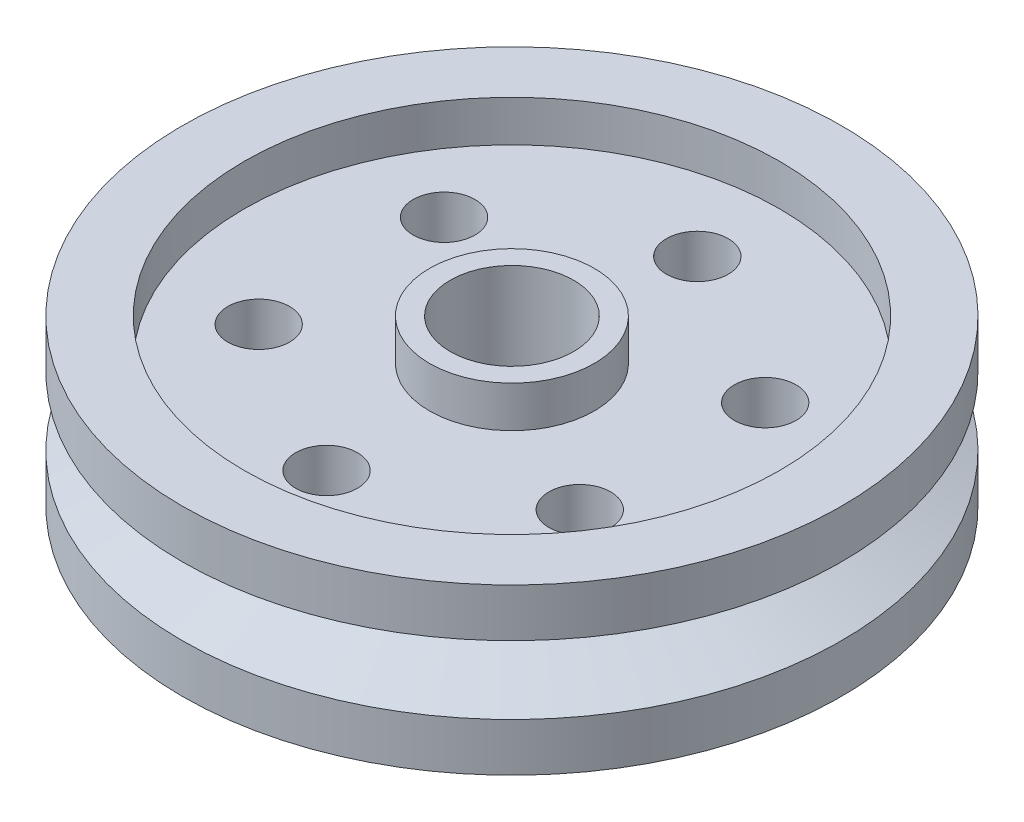
ISO-10303-21;
HEADER;
FILE_DESCRIPTION(('STEP AP214'),'2;1');
FILE_NAME('part.step','',(''),(''),'','','');
FILE_SCHEMA(('AUTOMOTIVE_DESIGN { 1 0 10303 214 1 1 1 1 }'));
ENDSEC;
DATA;
#1=APPLICATION_CONTEXT('core data for automotive mechanical design processes');
#2=APPLICATION_PROTOCOL_DEFINITION('international standard','automotive_design',2000,#1);
#3=PRODUCT_CONTEXT('',#1,'mechanical');
#4=PRODUCT('Part','Part','',(#3));
#5=PRODUCT_RELATED_PRODUCT_CATEGORY('part','',(#4));
#6=PRODUCT_DEFINITION_FORMATION('','',#4);
#7=PRODUCT_DEFINITION_CONTEXT('part definition',#1,'design');
#8=PRODUCT_DEFINITION('design','',#6,#7);
#9=PRODUCT_DEFINITION_SHAPE('','',#8);
#10=(LENGTH_UNIT() NAMED_UNIT(*) SI_UNIT(.MILLI.,.METRE.));
#11=(NAMED_UNIT(*) PLANE_ANGLE_UNIT() SI_UNIT($,.RADIAN.));
#12=(NAMED_UNIT(*) SI_UNIT($,.STERADIAN.) SOLID_ANGLE_UNIT());
#13=UNCERTAINTY_MEASURE_WITH_UNIT(LENGTH_MEASURE(1.E-05),#10,'distance_accuracy_value','');
#14=(GEOMETRIC_REPRESENTATION_CONTEXT(3) GLOBAL_UNCERTAINTY_ASSIGNED_CONTEXT((#13)) GLOBAL_UNIT_ASSIGNED_CONTEXT((#10,
#11,#12)) REPRESENTATION_CONTEXT('',''));
#15=CARTESIAN_POINT('',(0.,0.,0.));
#16=DIRECTION('',(0.,0.,1.));
#17=DIRECTION('',(1.,0.,0.));
#18=AXIS2_PLACEMENT_3D('',#15,#16,#17);
#19=CARTESIAN_POINT('',(0.,12.7,0.));
#20=DIRECTION('',(0.,-1.,0.));
#21=DIRECTION('',(0.,0.,-1.));
#22=AXIS2_PLACEMENT_3D('',#19,#20,#21);
#23=PLANE('',#22);
#24=CARTESIAN_POINT('',(0.,12.7,0.));
#25=DIRECTION('',(0.,1.,0.));
#26=DIRECTION('',(0.,0.,1.));
#27=AXIS2_PLACEMENT_3D('',#24,#25,#26);
#28=CIRCLE('',#27,41.275);
#29=CARTESIAN_POINT('',(0.,12.7,41.275));
#30=VERTEX_POINT('',#29);
#31=EDGE_CURVE('E51',#30,#30,#28,.T.);
#32=ORIENTED_EDGE('',*,*,#31,.F.);
#33=EDGE_LOOP('',(#32));
#34=FACE_BOUND('',#33,.T.);
#35=CARTESIAN_POINT('',(0.,12.7,0.));
#36=DIRECTION('',(0.,1.,0.));
#37=DIRECTION('',(0.,0.,1.));
#38=AXIS2_PLACEMENT_3D('',#35,#36,#37);
#39=CIRCLE('',#38,50.8);
#40=CARTESIAN_POINT('',(0.,12.7,50.8));
#41=VERTEX_POINT('',#40);
#42=EDGE_CURVE('E10',#41,#41,#39,.T.);
#43=ORIENTED_EDGE('',*,*,#42,.T.);
#44=EDGE_LOOP('',(#43));
#45=FACE_BOUND('',#44,.T.);
#46=ADVANCED_FACE('F37',(#34,#45),#23,.F.);
#47=CARTESIAN_POINT('',(0.,218.832128387009,0.));
#48=DIRECTION('',(0.,1.,0.));
#49=DIRECTION('',(0.,0.,1.));
#50=AXIS2_PLACEMENT_3D('',#47,#48,#49);
#51=CYLINDRICAL_SURFACE('',#50,50.8);
#52=ORIENTED_EDGE('',*,*,#42,.F.);
#53=EDGE_LOOP('',(#52));
#54=FACE_BOUND('',#53,.T.);
#55=CARTESIAN_POINT('',(0.,5.26051224213822,0.));
#56=DIRECTION('',(0.,1.,0.));
#57=DIRECTION('',(0.,0.,1.));
#58=AXIS2_PLACEMENT_3D('',#55,#56,#57);
#59=CIRCLE('',#58,50.8);
#60=CARTESIAN_POINT('',(0.,5.26051224213822,50.8));
#61=VERTEX_POINT('',#60);
#62=EDGE_CURVE('E43',#61,#61,#59,.T.);
#63=ORIENTED_EDGE('',*,*,#62,.T.);
#64=EDGE_LOOP('',(#63));
#65=FACE_BOUND('',#64,.T.);
#66=ADVANCED_FACE('F147',(#54,#65),#51,.T.);
#67=CARTESIAN_POINT('',(0.,0.,0.));
#68=DIRECTION('',(0.,1.,0.));
#69=DIRECTION('',(0.,0.,1.));
#70=AXIS2_PLACEMENT_3D('',#67,#68,#69);
#71=CONICAL_SURFACE('',#70,38.1,1.17809724509618);
#72=ORIENTED_EDGE('',*,*,#62,.F.);
#73=EDGE_LOOP('',(#72));
#74=FACE_BOUND('',#73,.T.);
#75=CARTESIAN_POINT('',(0.,0.,0.));
#76=DIRECTION('',(0.,1.,0.));
#77=DIRECTION('',(0.,0.,1.));
#78=AXIS2_PLACEMENT_3D('',#75,#76,#77);
#79=CIRCLE('',#78,38.1);
#80=CARTESIAN_POINT('',(0.,0.,38.1));
#81=VERTEX_POINT('',#80);
#82=EDGE_CURVE('E89',#81,#81,#79,.T.);
#83=ORIENTED_EDGE('',*,*,#82,.T.);
#84=EDGE_LOOP('',(#83));
#85=FACE_BOUND('',#84,.T.);
#86=ADVANCED_FACE('F153',(#74,#85),#71,.T.);
#87=CARTESIAN_POINT('',(0.,6.34999999999999,0.));
#88=DIRECTION('',(0.,1.,0.));
#89=DIRECTION('',(0.,0.,1.));
#90=AXIS2_PLACEMENT_3D('',#87,#88,#89);
#91=CYLINDRICAL_SURFACE('',#90,41.275);
#92=CARTESIAN_POINT('',(0.,6.34999999999999,0.));
#93=DIRECTION('',(0.,1.,0.));
#94=DIRECTION('',(0.,0.,1.));
#95=AXIS2_PLACEMENT_3D('',#92,#93,#94);
#96=CIRCLE('',#95,41.275);
#97=CARTESIAN_POINT('',(0.,6.34999999999999,41.275));
#98=VERTEX_POINT('',#97);
#99=EDGE_CURVE('E47',#98,#98,#96,.T.);
#100=ORIENTED_EDGE('',*,*,#99,.F.);
#101=EDGE_LOOP('',(#100));
#102=FACE_BOUND('',#101,.T.);
#103=ORIENTED_EDGE('',*,*,#31,.T.);
#104=EDGE_LOOP('',(#103));
#105=FACE_BOUND('',#104,.T.);
#106=ADVANCED_FACE('F210',(#102,#105),#91,.F.);
#107=CARTESIAN_POINT('',(0.,6.34999999999999,0.));
#108=DIRECTION('',(0.,1.,0.));
#109=DIRECTION('',(0.,0.,1.));
#110=AXIS2_PLACEMENT_3D('',#107,#108,#109);
#111=PLANE('',#110);
#112=CARTESIAN_POINT('',(-24.7466759131403,6.34999999999999,14.2875000000001));
#113=DIRECTION('',(0.,1.,0.));
#114=DIRECTION('',(0.866025403784436,0.,-0.500000000000004));
#115=AXIS2_PLACEMENT_3D('',#112,#113,#114);
#116=CIRCLE('',#115,4.7625);
#117=CARTESIAN_POINT('',(-20.6222299276169,6.34999999999999,11.9062500000001));
#118=VERTEX_POINT('',#117);
#119=EDGE_CURVE('E71',#118,#118,#116,.T.);
#120=ORIENTED_EDGE('',*,*,#119,.F.);
#121=EDGE_LOOP('',(#120));
#122=FACE_BOUND('',#121,.T.);
#123=CARTESIAN_POINT('',(0.,6.34999999999999,28.575));
#124=DIRECTION('',(0.,1.,0.));
#125=DIRECTION('',(0.,0.,-1.));
#126=AXIS2_PLACEMENT_3D('',#123,#124,#125);
#127=CIRCLE('',#126,4.7625);
#128=CARTESIAN_POINT('',(0.,6.34999999999999,23.8125));
#129=VERTEX_POINT('',#128);
#130=EDGE_CURVE('E79',#129,#129,#127,.T.);
#131=ORIENTED_EDGE('',*,*,#130,.F.);
#132=EDGE_LOOP('',(#131));
#133=FACE_BOUND('',#132,.T.);
#134=CARTESIAN_POINT('',(24.7466759131405,6.34999999999999,14.2874999999998));
#135=DIRECTION('',(0.,1.,0.));
#136=DIRECTION('',(-0.866025403784443,0.,-0.499999999999992));
#137=AXIS2_PLACEMENT_3D('',#134,#135,#136);
#138=CIRCLE('',#137,4.7625);
#139=CARTESIAN_POINT('',(20.6222299276171,6.34999999999999,11.9062499999998));
#140=VERTEX_POINT('',#139);
#141=EDGE_CURVE('E75',#140,#140,#138,.T.);
#142=ORIENTED_EDGE('',*,*,#141,.F.);
#143=EDGE_LOOP('',(#142));
#144=FACE_BOUND('',#143,.T.);
#145=CARTESIAN_POINT('',(24.7466759131402,6.34999999999999,-14.2875000000003));
#146=DIRECTION('',(0.,1.,0.));
#147=DIRECTION('',(-0.866025403784433,0.,0.50000000000001));
#148=AXIS2_PLACEMENT_3D('',#145,#146,#147);
#149=CIRCLE('',#148,4.7625);
#150=CARTESIAN_POINT('',(20.6222299276168,6.34999999999999,-11.9062500000002));
#151=VERTEX_POINT('',#150);
#152=EDGE_CURVE('E72',#151,#151,#149,.T.);
#153=ORIENTED_EDGE('',*,*,#152,.F.);
#154=EDGE_LOOP('',(#153));
#155=FACE_BOUND('',#154,.T.);
#156=CARTESIAN_POINT('',(-24.7466759131404,6.34999999999999,-14.2874999999999));
#157=DIRECTION('',(0.,1.,0.));
#158=DIRECTION('',(0.86602540378444,0.,0.499999999999998));
#159=AXIS2_PLACEMENT_3D('',#156,#157,#158);
#160=CIRCLE('',#159,4.7625);
#161=CARTESIAN_POINT('',(-20.622229927617,6.34999999999999,-11.90625));
#162=VERTEX_POINT('',#161);
#163=EDGE_CURVE('E68',#162,#162,#160,.T.);
#164=ORIENTED_EDGE('',*,*,#163,.F.);
#165=EDGE_LOOP('',(#164));
#166=FACE_BOUND('',#165,.T.);
#167=CARTESIAN_POINT('',(0.,6.34999999999999,-28.575));
#168=DIRECTION('',(0.,1.,0.));
#169=DIRECTION('',(0.,0.,1.));
#170=AXIS2_PLACEMENT_3D('',#167,#168,#169);
#171=CIRCLE('',#170,4.7625);
#172=CARTESIAN_POINT('',(0.,6.34999999999999,-23.8125));
#173=VERTEX_POINT('',#172);
#174=EDGE_CURVE('E65',#173,#173,#171,.T.);
#175=ORIENTED_EDGE('',*,*,#174,.F.);
#176=EDGE_LOOP('',(#175));
#177=FACE_BOUND('',#176,.T.);
#178=CARTESIAN_POINT('',(0.,6.34999999999999,0.));
#179=DIRECTION('',(0.,1.,0.));
#180=DIRECTION('',(0.,0.,1.));
#181=AXIS2_PLACEMENT_3D('',#178,#179,#180);
#182=CIRCLE('',#181,12.7);
#183=CARTESIAN_POINT('',(0.,6.34999999999999,12.7));
#184=VERTEX_POINT('',#183);
#185=EDGE_CURVE('E55',#184,#184,#182,.T.);
#186=ORIENTED_EDGE('',*,*,#185,.F.);
#187=EDGE_LOOP('',(#186));
#188=FACE_BOUND('',#187,.T.);
#189=ORIENTED_EDGE('',*,*,#99,.T.);
#190=EDGE_LOOP('',(#189));
#191=FACE_BOUND('',#190,.T.);
#192=ADVANCED_FACE('F167',(#122,#133,#144,#155,#166,#177,#188,#191),#111,.T.);
#193=CARTESIAN_POINT('',(0.,6.34999999999999,0.));
#194=DIRECTION('',(0.,1.,0.));
#195=DIRECTION('',(0.,0.,1.));
#196=AXIS2_PLACEMENT_3D('',#193,#194,#195);
#197=CYLINDRICAL_SURFACE('',#196,12.7);
#198=ORIENTED_EDGE('',*,*,#185,.T.);
#199=EDGE_LOOP('',(#198));
#200=FACE_BOUND('',#199,.T.);
#201=CARTESIAN_POINT('',(0.,12.7,0.));
#202=DIRECTION('',(0.,1.,0.));
#203=DIRECTION('',(0.,0.,1.));
#204=AXIS2_PLACEMENT_3D('',#201,#202,#203);
#205=CIRCLE('',#204,12.7);
#206=CARTESIAN_POINT('',(0.,12.7,12.7));
#207=VERTEX_POINT('',#206);
#208=EDGE_CURVE('E57',#207,#207,#205,.T.);
#209=ORIENTED_EDGE('',*,*,#208,.F.);
#210=EDGE_LOOP('',(#209));
#211=FACE_BOUND('',#210,.T.);
#212=ADVANCED_FACE('F158',(#200,#211),#197,.T.);
#213=CARTESIAN_POINT('',(0.,12.7,0.));
#214=DIRECTION('',(0.,1.,0.));
#215=DIRECTION('',(0.,0.,1.));
#216=AXIS2_PLACEMENT_3D('',#213,#214,#215);
#217=CIRCLE('',#216,9.525);
#218=CARTESIAN_POINT('',(0.,12.7,9.525));
#219=VERTEX_POINT('',#218);
#220=EDGE_CURVE('E60',#219,#219,#217,.T.);
#221=ORIENTED_EDGE('',*,*,#220,.F.);
#222=EDGE_LOOP('',(#221));
#223=FACE_BOUND('',#222,.T.);
#224=ORIENTED_EDGE('',*,*,#208,.T.);
#225=EDGE_LOOP('',(#224));
#226=FACE_BOUND('',#225,.T.);
#227=ADVANCED_FACE('F149',(#223,#226),#23,.F.);
#228=CARTESIAN_POINT('',(0.,0.,0.));
#229=DIRECTION('',(0.,1.,0.));
#230=DIRECTION('',(0.,0.,1.));
#231=AXIS2_PLACEMENT_3D('',#228,#229,#230);
#232=CYLINDRICAL_SURFACE('',#231,9.525);
#233=ORIENTED_EDGE('',*,*,#220,.T.);
#234=EDGE_LOOP('',(#233));
#235=FACE_BOUND('',#234,.T.);
#236=CARTESIAN_POINT('',(0.,-12.7,0.));
#237=DIRECTION('',(0.,1.,0.));
#238=DIRECTION('',(0.,0.,1.));
#239=AXIS2_PLACEMENT_3D('',#236,#237,#238);
#240=CIRCLE('',#239,9.525);
#241=CARTESIAN_POINT('',(0.,-12.7,9.525));
#242=VERTEX_POINT('',#241);
#243=EDGE_CURVE('E102',#242,#242,#240,.T.);
#244=ORIENTED_EDGE('',*,*,#243,.F.);
#245=EDGE_LOOP('',(#244));
#246=FACE_BOUND('',#245,.T.);
#247=ADVANCED_FACE('F157',(#235,#246),#232,.F.);
#248=CARTESIAN_POINT('',(0.,0.,-28.575));
#249=DIRECTION('',(0.,1.,0.));
#250=DIRECTION('',(0.,0.,1.));
#251=AXIS2_PLACEMENT_3D('',#248,#249,#250);
#252=CYLINDRICAL_SURFACE('',#251,4.7625);
#253=ORIENTED_EDGE('',*,*,#174,.T.);
#254=EDGE_LOOP('',(#253));
#255=FACE_BOUND('',#254,.T.);
#256=CARTESIAN_POINT('',(0.,-6.34999999999999,-28.575));
#257=DIRECTION('',(0.,1.,0.));
#258=DIRECTION('',(0.,0.,1.));
#259=AXIS2_PLACEMENT_3D('',#256,#257,#258);
#260=CIRCLE('',#259,4.7625);
#261=CARTESIAN_POINT('',(0.,-6.34999999999999,-23.8125));
#262=VERTEX_POINT('',#261);
#263=EDGE_CURVE('E107',#262,#262,#260,.T.);
#264=ORIENTED_EDGE('',*,*,#263,.F.);
#265=EDGE_LOOP('',(#264));
#266=FACE_BOUND('',#265,.T.);
#267=ADVANCED_FACE('F164',(#255,#266),#252,.F.);
#268=CARTESIAN_POINT('',(-24.7466759131404,0.,-14.2874999999999));
#269=DIRECTION('',(0.,1.,0.));
#270=DIRECTION('',(0.,0.,1.));
#271=AXIS2_PLACEMENT_3D('',#268,#269,#270);
#272=CYLINDRICAL_SURFACE('',#271,4.7625);
#273=ORIENTED_EDGE('',*,*,#163,.T.);
#274=EDGE_LOOP('',(#273));
#275=FACE_BOUND('',#274,.T.);
#276=CARTESIAN_POINT('',(-24.7466759131404,-6.34999999999999,-14.2874999999999));
#277=DIRECTION('',(0.,1.,0.));
#278=DIRECTION('',(0.86602540378444,0.,0.499999999999998));
#279=AXIS2_PLACEMENT_3D('',#276,#277,#278);
#280=CIRCLE('',#279,4.7625);
#281=CARTESIAN_POINT('',(-20.622229927617,-6.34999999999999,-11.90625));
#282=VERTEX_POINT('',#281);
#283=EDGE_CURVE('E110',#282,#282,#280,.T.);
#284=ORIENTED_EDGE('',*,*,#283,.F.);
#285=EDGE_LOOP('',(#284));
#286=FACE_BOUND('',#285,.T.);
#287=ADVANCED_FACE('F224',(#275,#286),#272,.F.);
#288=CARTESIAN_POINT('',(24.7466759131402,0.,-14.2875000000003));
#289=DIRECTION('',(0.,1.,0.));
#290=DIRECTION('',(0.,0.,1.));
#291=AXIS2_PLACEMENT_3D('',#288,#289,#290);
#292=CYLINDRICAL_SURFACE('',#291,4.7625);
#293=ORIENTED_EDGE('',*,*,#152,.T.);
#294=EDGE_LOOP('',(#293));
#295=FACE_BOUND('',#294,.T.);
#296=CARTESIAN_POINT('',(24.7466759131402,-6.34999999999999,-14.2875000000003));
#297=DIRECTION('',(0.,1.,0.));
#298=DIRECTION('',(-0.866025403784433,0.,0.50000000000001));
#299=AXIS2_PLACEMENT_3D('',#296,#297,#298);
#300=CIRCLE('',#299,4.7625);
#301=CARTESIAN_POINT('',(20.6222299276168,-6.34999999999999,-11.9062500000002));
#302=VERTEX_POINT('',#301);
#303=EDGE_CURVE('E114',#302,#302,#300,.T.);
#304=ORIENTED_EDGE('',*,*,#303,.F.);
#305=EDGE_LOOP('',(#304));
#306=FACE_BOUND('',#305,.T.);
#307=ADVANCED_FACE('F228',(#295,#306),#292,.F.);
#308=CARTESIAN_POINT('',(24.7466759131405,0.,14.2874999999998));
#309=DIRECTION('',(0.,1.,0.));
#310=DIRECTION('',(0.,0.,1.));
#311=AXIS2_PLACEMENT_3D('',#308,#309,#310);
#312=CYLINDRICAL_SURFACE('',#311,4.7625);
#313=ORIENTED_EDGE('',*,*,#141,.T.);
#314=EDGE_LOOP('',(#313));
#315=FACE_BOUND('',#314,.T.);
#316=CARTESIAN_POINT('',(24.7466759131405,-6.34999999999999,14.2874999999998));
#317=DIRECTION('',(0.,1.,0.));
#318=DIRECTION('',(-0.866025403784443,0.,-0.499999999999992));
#319=AXIS2_PLACEMENT_3D('',#316,#317,#318);
#320=CIRCLE('',#319,4.7625);
#321=CARTESIAN_POINT('',(20.6222299276171,-6.34999999999999,11.9062499999998));
#322=VERTEX_POINT('',#321);
#323=EDGE_CURVE('E117',#322,#322,#320,.T.);
#324=ORIENTED_EDGE('',*,*,#323,.F.);
#325=EDGE_LOOP('',(#324));
#326=FACE_BOUND('',#325,.T.);
#327=ADVANCED_FACE('F143',(#315,#326),#312,.F.);
#328=CARTESIAN_POINT('',(0.,0.,28.575));
#329=DIRECTION('',(0.,1.,0.));
#330=DIRECTION('',(0.,0.,1.));
#331=AXIS2_PLACEMENT_3D('',#328,#329,#330);
#332=CYLINDRICAL_SURFACE('',#331,4.7625);
#333=ORIENTED_EDGE('',*,*,#130,.T.);
#334=EDGE_LOOP('',(#333));
#335=FACE_BOUND('',#334,.T.);
#336=CARTESIAN_POINT('',(0.,-6.34999999999999,28.575));
#337=DIRECTION('',(0.,1.,0.));
#338=DIRECTION('',(0.,0.,-1.));
#339=AXIS2_PLACEMENT_3D('',#336,#337,#338);
#340=CIRCLE('',#339,4.7625);
#341=CARTESIAN_POINT('',(0.,-6.34999999999999,23.8125));
#342=VERTEX_POINT('',#341);
#343=EDGE_CURVE('E120',#342,#342,#340,.T.);
#344=ORIENTED_EDGE('',*,*,#343,.F.);
#345=EDGE_LOOP('',(#344));
#346=FACE_BOUND('',#345,.T.);
#347=ADVANCED_FACE('F132',(#335,#346),#332,.F.);
#348=CARTESIAN_POINT('',(-24.7466759131403,0.,14.2875000000001));
#349=DIRECTION('',(0.,1.,0.));
#350=DIRECTION('',(0.,0.,1.));
#351=AXIS2_PLACEMENT_3D('',#348,#349,#350);
#352=CYLINDRICAL_SURFACE('',#351,4.7625);
#353=ORIENTED_EDGE('',*,*,#119,.T.);
#354=EDGE_LOOP('',(#353));
#355=FACE_BOUND('',#354,.T.);
#356=CARTESIAN_POINT('',(-24.7466759131403,-6.34999999999999,14.2875000000001));
#357=DIRECTION('',(0.,1.,0.));
#358=DIRECTION('',(0.866025403784436,0.,-0.500000000000004));
#359=AXIS2_PLACEMENT_3D('',#356,#357,#358);
#360=CIRCLE('',#359,4.7625);
#361=CARTESIAN_POINT('',(-20.6222299276169,-6.34999999999999,11.9062500000001));
#362=VERTEX_POINT('',#361);
#363=EDGE_CURVE('E113',#362,#362,#360,.T.);
#364=ORIENTED_EDGE('',*,*,#363,.F.);
#365=EDGE_LOOP('',(#364));
#366=FACE_BOUND('',#365,.T.);
#367=ADVANCED_FACE('F129',(#355,#366),#352,.F.);
#368=CARTESIAN_POINT('',(0.,-12.7,0.));
#369=DIRECTION('',(0.,1.,0.));
#370=DIRECTION('',(0.,0.,-1.));
#371=AXIS2_PLACEMENT_3D('',#368,#369,#370);
#372=PLANE('',#371);
#373=CARTESIAN_POINT('',(0.,-12.7,0.));
#374=DIRECTION('',(0.,1.,0.));
#375=DIRECTION('',(0.,0.,1.));
#376=AXIS2_PLACEMENT_3D('',#373,#374,#375);
#377=CIRCLE('',#376,41.275);
#378=CARTESIAN_POINT('',(0.,-12.7,41.275));
#379=VERTEX_POINT('',#378);
#380=EDGE_CURVE('E93',#379,#379,#377,.T.);
#381=ORIENTED_EDGE('',*,*,#380,.T.);
#382=EDGE_LOOP('',(#381));
#383=FACE_BOUND('',#382,.T.);
#384=CARTESIAN_POINT('',(0.,-12.7,0.));
#385=DIRECTION('',(0.,1.,0.));
#386=DIRECTION('',(0.,0.,1.));
#387=AXIS2_PLACEMENT_3D('',#384,#385,#386);
#388=CIRCLE('',#387,50.8);
#389=CARTESIAN_POINT('',(0.,-12.7,50.8));
#390=VERTEX_POINT('',#389);
#391=EDGE_CURVE('E76',#390,#390,#388,.T.);
#392=ORIENTED_EDGE('',*,*,#391,.F.);
#393=EDGE_LOOP('',(#392));
#394=FACE_BOUND('',#393,.T.);
#395=ADVANCED_FACE('F131',(#383,#394),#372,.F.);
#396=CARTESIAN_POINT('',(0.,-218.832128387009,0.));
#397=DIRECTION('',(0.,-1.,0.));
#398=DIRECTION('',(0.,0.,1.));
#399=AXIS2_PLACEMENT_3D('',#396,#397,#398);
#400=CYLINDRICAL_SURFACE('',#399,50.8);
#401=ORIENTED_EDGE('',*,*,#391,.T.);
#402=EDGE_LOOP('',(#401));
#403=FACE_BOUND('',#402,.T.);
#404=CARTESIAN_POINT('',(0.,-5.26051224213822,0.));
#405=DIRECTION('',(0.,1.,0.));
#406=DIRECTION('',(0.,0.,1.));
#407=AXIS2_PLACEMENT_3D('',#404,#405,#406);
#408=CIRCLE('',#407,50.8);
#409=CARTESIAN_POINT('',(0.,-5.26051224213822,50.8));
#410=VERTEX_POINT('',#409);
#411=EDGE_CURVE('E86',#410,#410,#408,.T.);
#412=ORIENTED_EDGE('',*,*,#411,.F.);
#413=EDGE_LOOP('',(#412));
#414=FACE_BOUND('',#413,.T.);
#415=ADVANCED_FACE('F139',(#403,#414),#400,.T.);
#416=CARTESIAN_POINT('',(0.,0.,0.));
#417=DIRECTION('',(0.,-1.,0.));
#418=DIRECTION('',(0.,0.,1.));
#419=AXIS2_PLACEMENT_3D('',#416,#417,#418);
#420=CONICAL_SURFACE('',#419,38.1,1.17809724509618);
#421=ORIENTED_EDGE('',*,*,#411,.T.);
#422=EDGE_LOOP('',(#421));
#423=FACE_BOUND('',#422,.T.);
#424=ORIENTED_EDGE('',*,*,#82,.F.);
#425=EDGE_LOOP('',(#424));
#426=FACE_BOUND('',#425,.T.);
#427=ADVANCED_FACE('F194',(#423,#426),#420,.T.);
#428=CARTESIAN_POINT('',(0.,-6.34999999999999,0.));
#429=DIRECTION('',(0.,-1.,0.));
#430=DIRECTION('',(0.,0.,1.));
#431=AXIS2_PLACEMENT_3D('',#428,#429,#430);
#432=CYLINDRICAL_SURFACE('',#431,41.275);
#433=CARTESIAN_POINT('',(0.,-6.34999999999999,0.));
#434=DIRECTION('',(0.,1.,0.));
#435=DIRECTION('',(0.,0.,1.));
#436=AXIS2_PLACEMENT_3D('',#433,#434,#435);
#437=CIRCLE('',#436,41.275);
#438=CARTESIAN_POINT('',(0.,-6.34999999999999,41.275));
#439=VERTEX_POINT('',#438);
#440=EDGE_CURVE('E92',#439,#439,#437,.T.);
#441=ORIENTED_EDGE('',*,*,#440,.T.);
#442=EDGE_LOOP('',(#441));
#443=FACE_BOUND('',#442,.T.);
#444=ORIENTED_EDGE('',*,*,#380,.F.);
#445=EDGE_LOOP('',(#444));
#446=FACE_BOUND('',#445,.T.);
#447=ADVANCED_FACE('F188',(#443,#446),#432,.F.);
#448=CARTESIAN_POINT('',(0.,-6.34999999999999,0.));
#449=DIRECTION('',(0.,-1.,0.));
#450=DIRECTION('',(0.,0.,1.));
#451=AXIS2_PLACEMENT_3D('',#448,#449,#450);
#452=PLANE('',#451);
#453=ORIENTED_EDGE('',*,*,#363,.T.);
#454=EDGE_LOOP('',(#453));
#455=FACE_BOUND('',#454,.T.);
#456=ORIENTED_EDGE('',*,*,#343,.T.);
#457=EDGE_LOOP('',(#456));
#458=FACE_BOUND('',#457,.T.);
#459=ORIENTED_EDGE('',*,*,#323,.T.);
#460=EDGE_LOOP('',(#459));
#461=FACE_BOUND('',#460,.T.);
#462=ORIENTED_EDGE('',*,*,#303,.T.);
#463=EDGE_LOOP('',(#462));
#464=FACE_BOUND('',#463,.T.);
#465=ORIENTED_EDGE('',*,*,#283,.T.);
#466=EDGE_LOOP('',(#465));
#467=FACE_BOUND('',#466,.T.);
#468=ORIENTED_EDGE('',*,*,#263,.T.);
#469=EDGE_LOOP('',(#468));
#470=FACE_BOUND('',#469,.T.);
#471=CARTESIAN_POINT('',(0.,-6.34999999999999,0.));
#472=DIRECTION('',(0.,1.,0.));
#473=DIRECTION('',(0.,0.,1.));
#474=AXIS2_PLACEMENT_3D('',#471,#472,#473);
#475=CIRCLE('',#474,12.7);
#476=CARTESIAN_POINT('',(0.,-6.34999999999999,12.7));
#477=VERTEX_POINT('',#476);
#478=EDGE_CURVE('E96',#477,#477,#475,.T.);
#479=ORIENTED_EDGE('',*,*,#478,.T.);
#480=EDGE_LOOP('',(#479));
#481=FACE_BOUND('',#480,.T.);
#482=ORIENTED_EDGE('',*,*,#440,.F.);
#483=EDGE_LOOP('',(#482));
#484=FACE_BOUND('',#483,.T.);
#485=ADVANCED_FACE('F126',(#455,#458,#461,#464,#467,#470,#481,#484),#452,.T.);
#486=CARTESIAN_POINT('',(0.,-6.34999999999999,0.));
#487=DIRECTION('',(0.,-1.,0.));
#488=DIRECTION('',(0.,0.,1.));
#489=AXIS2_PLACEMENT_3D('',#486,#487,#488);
#490=CYLINDRICAL_SURFACE('',#489,12.7);
#491=ORIENTED_EDGE('',*,*,#478,.F.);
#492=EDGE_LOOP('',(#491));
#493=FACE_BOUND('',#492,.T.);
#494=CARTESIAN_POINT('',(0.,-12.7,0.));
#495=DIRECTION('',(0.,1.,0.));
#496=DIRECTION('',(0.,0.,1.));
#497=AXIS2_PLACEMENT_3D('',#494,#495,#496);
#498=CIRCLE('',#497,12.7);
#499=CARTESIAN_POINT('',(0.,-12.7,12.7));
#500=VERTEX_POINT('',#499);
#501=EDGE_CURVE('E99',#500,#500,#498,.T.);
#502=ORIENTED_EDGE('',*,*,#501,.T.);
#503=EDGE_LOOP('',(#502));
#504=FACE_BOUND('',#503,.T.);
#505=ADVANCED_FACE('F179',(#493,#504),#490,.T.);
#506=ORIENTED_EDGE('',*,*,#243,.T.);
#507=EDGE_LOOP('',(#506));
#508=FACE_BOUND('',#507,.T.);
#509=ORIENTED_EDGE('',*,*,#501,.F.);
#510=EDGE_LOOP('',(#509));
#511=FACE_BOUND('',#510,.T.);
#512=ADVANCED_FACE('F142',(#508,#511),#372,.F.);
#513=CLOSED_SHELL('',(#46,#66,#86,#106,#192,#212,#227,#247,#267,#287,#307,#327,#347,#367,#395,
#415,#427,#447,#485,#505,#512));
#514=MANIFOLD_SOLID_BREP('B2',#513);
#515=ADVANCED_BREP_SHAPE_REPRESENTATION('',(#18,#514),#14);
#516=SHAPE_DEFINITION_REPRESENTATION(#9,#515);
ENDSEC;
END-ISO-10303-21;
